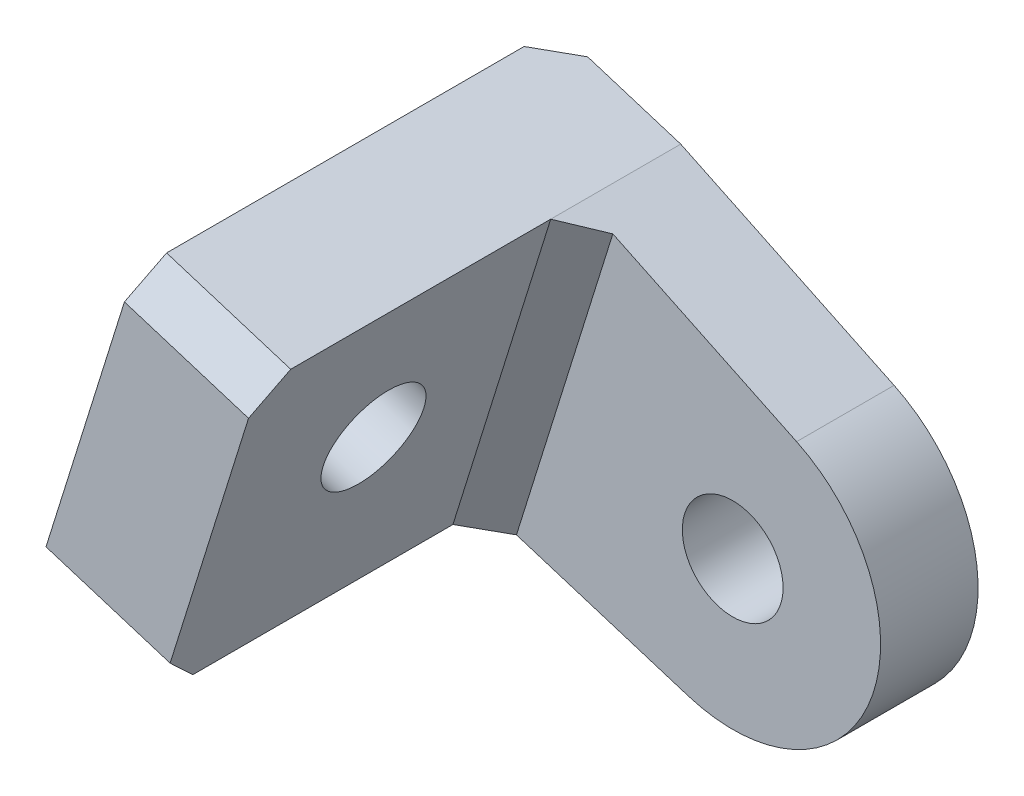
ISO-10303-21;
HEADER;
FILE_DESCRIPTION(('STEP AP214'),'2;1');
FILE_NAME('part.step','',(''),(''),'','','');
FILE_SCHEMA(('AUTOMOTIVE_DESIGN { 1 0 10303 214 1 1 1 1 }'));
ENDSEC;
DATA;
#1=APPLICATION_CONTEXT('core data for automotive mechanical design processes');
#2=APPLICATION_PROTOCOL_DEFINITION('international standard','automotive_design',2000,#1);
#3=PRODUCT_CONTEXT('',#1,'mechanical');
#4=PRODUCT('Part','Part','',(#3));
#5=PRODUCT_RELATED_PRODUCT_CATEGORY('part','',(#4));
#6=PRODUCT_DEFINITION_FORMATION('','',#4);
#7=PRODUCT_DEFINITION_CONTEXT('part definition',#1,'design');
#8=PRODUCT_DEFINITION('design','',#6,#7);
#9=PRODUCT_DEFINITION_SHAPE('','',#8);
#10=(LENGTH_UNIT() NAMED_UNIT(*) SI_UNIT(.MILLI.,.METRE.));
#11=(NAMED_UNIT(*) PLANE_ANGLE_UNIT() SI_UNIT($,.RADIAN.));
#12=(NAMED_UNIT(*) SI_UNIT($,.STERADIAN.) SOLID_ANGLE_UNIT());
#13=UNCERTAINTY_MEASURE_WITH_UNIT(LENGTH_MEASURE(1.E-05),#10,'distance_accuracy_value','');
#14=(GEOMETRIC_REPRESENTATION_CONTEXT(3) GLOBAL_UNCERTAINTY_ASSIGNED_CONTEXT((#13)) GLOBAL_UNIT_ASSIGNED_CONTEXT((#10,
#11,#12)) REPRESENTATION_CONTEXT('',''));
#15=CARTESIAN_POINT('',(0.,0.,0.));
#16=DIRECTION('',(0.,0.,1.));
#17=DIRECTION('',(1.,0.,0.));
#18=AXIS2_PLACEMENT_3D('',#15,#16,#17);
#19=CARTESIAN_POINT('',(12.6458721758377,26.3905196953717,3.));
#20=DIRECTION('',(0.432131708683439,0.90181050467952,0.));
#21=DIRECTION('',(-0.90181050467952,0.43213170868344,0.));
#22=AXIS2_PLACEMENT_3D('',#19,#20,#21);
#23=PLANE('',#22);
#24=DIRECTION('',(0.90181050467952,-0.432131708683439,0.));
#25=VECTOR('',#24,1.);
#26=CARTESIAN_POINT('',(12.6458721758377,26.3905196953717,0.));
#27=LINE('',#26,#25);
#28=CARTESIAN_POINT('',(2.67565379619653,31.1680727200756,0.));
#29=VERTEX_POINT('',#28);
#30=CARTESIAN_POINT('',(9.24108820924442,28.0220321977735,0.));
#31=VERTEX_POINT('',#30);
#32=EDGE_CURVE('E157',#29,#31,#27,.T.);
#33=ORIENTED_EDGE('',*,*,#32,.F.);
#34=DIRECTION('',(0.,0.,-1.));
#35=VECTOR('',#34,1.);
#36=CARTESIAN_POINT('',(2.67565379619653,31.1680727200756,3.));
#37=LINE('',#36,#35);
#38=CARTESIAN_POINT('',(2.67565379619653,31.1680727200756,4.00000000000001));
#39=VERTEX_POINT('',#38);
#40=EDGE_CURVE('E148',#39,#29,#37,.T.);
#41=ORIENTED_EDGE('',*,*,#40,.F.);
#42=DIRECTION('',(0.64100135330547,-0.307156557430796,-0.703400394006016));
#43=VECTOR('',#42,1.);
#44=CARTESIAN_POINT('',(3.33765436171891,30.8508537100461,3.27355620043639));
#45=LINE('',#44,#43);
#46=CARTESIAN_POINT('',(3.58694323926157,30.7313988710868,3.));
#47=VERTEX_POINT('',#46);
#48=EDGE_CURVE('E203',#39,#47,#45,.T.);
#49=ORIENTED_EDGE('',*,*,#48,.T.);
#50=DIRECTION('',(0.90181050467952,-0.432131708683439,0.));
#51=VECTOR('',#50,1.);
#52=CARTESIAN_POINT('',(12.6458721758377,26.3905196953717,3.));
#53=LINE('',#52,#51);
#54=CARTESIAN_POINT('',(9.24108820924442,28.0220321977735,3.));
#55=VERTEX_POINT('',#54);
#56=EDGE_CURVE('E141',#47,#55,#53,.T.);
#57=ORIENTED_EDGE('',*,*,#56,.T.);
#58=DIRECTION('',(0.,0.,-1.));
#59=VECTOR('',#58,1.);
#60=CARTESIAN_POINT('',(9.24108820924442,28.0220321977735,3.));
#61=LINE('',#60,#59);
#62=EDGE_CURVE('E127',#55,#31,#61,.T.);
#63=ORIENTED_EDGE('',*,*,#62,.T.);
#64=EDGE_LOOP('',(#33,#41,#49,#57,#63));
#65=FACE_BOUND('',#64,.T.);
#66=ADVANCED_FACE('F35',(#65),#23,.T.);
#67=CARTESIAN_POINT('',(9.10096871201294,29.1629022647186,3.));
#68=DIRECTION('',(0.297904049493287,0.954595818813125,0.));
#69=DIRECTION('',(-0.954595818813125,0.297904049493287,0.));
#70=AXIS2_PLACEMENT_3D('',#67,#68,#69);
#71=PLANE('',#70);
#72=DIRECTION('',(0.954595818813125,-0.297904049493287,0.));
#73=VECTOR('',#72,1.);
#74=CARTESIAN_POINT('',(9.10096871201294,29.1629022647186,0.));
#75=LINE('',#74,#73);
#76=CARTESIAN_POINT('',(-0.188133660242845,32.0617848685554,0.));
#77=VERTEX_POINT('',#76);
#78=EDGE_CURVE('E160',#77,#29,#75,.T.);
#79=ORIENTED_EDGE('',*,*,#78,.F.);
#80=DIRECTION('',(-0.675001176775085,0.210649973539636,0.707106781186549));
#81=VECTOR('',#80,1.);
#82=CARTESIAN_POINT('',(3.02452379766534,31.059199640877,-3.36546357588553));
#83=LINE('',#82,#81);
#84=CARTESIAN_POINT('',(-1.14272947905597,32.3596889180487,1.));
#85=VERTEX_POINT('',#84);
#86=EDGE_CURVE('E57',#77,#85,#83,.T.);
#87=ORIENTED_EDGE('',*,*,#86,.T.);
#88=DIRECTION('',(0.,0.,-1.));
#89=VECTOR('',#88,1.);
#90=CARTESIAN_POINT('',(-1.14272947905597,32.3596889180487,3.));
#91=LINE('',#90,#89);
#92=CARTESIAN_POINT('',(-1.14272947905597,32.3596889180487,12.));
#93=VERTEX_POINT('',#92);
#94=EDGE_CURVE('E169',#93,#85,#91,.T.);
#95=ORIENTED_EDGE('',*,*,#94,.F.);
#96=DIRECTION('',(0.954595818813125,-0.297904049493287,0.));
#97=VECTOR('',#96,1.);
#98=CARTESIAN_POINT('',(9.10096871201294,29.1629022647186,12.));
#99=LINE('',#98,#97);
#100=CARTESIAN_POINT('',(2.67565379619653,31.1680727200756,12.));
#101=VERTEX_POINT('',#100);
#102=EDGE_CURVE('E197',#93,#101,#99,.T.);
#103=ORIENTED_EDGE('',*,*,#102,.T.);
#104=DIRECTION('',(0.,0.,-1.));
#105=VECTOR('',#104,1.);
#106=CARTESIAN_POINT('',(2.67565379619653,31.1680727200756,13.));
#107=LINE('',#106,#105);
#108=EDGE_CURVE('E187',#101,#39,#107,.T.);
#109=ORIENTED_EDGE('',*,*,#108,.T.);
#110=ORIENTED_EDGE('',*,*,#40,.T.);
#111=EDGE_LOOP('',(#79,#87,#95,#103,#109,#110));
#112=FACE_BOUND('',#111,.T.);
#113=ADVANCED_FACE('F216',(#112),#71,.T.);
#114=CARTESIAN_POINT('',(-10.2436981910689,3.19678665333007,3.));
#115=DIRECTION('',(-0.954595818813125,0.297904049493287,0.));
#116=DIRECTION('',(-0.297904049493287,-0.954595818813125,0.));
#117=AXIS2_PLACEMENT_3D('',#114,#115,#116);
#118=PLANE('',#117);
#119=CARTESIAN_POINT('',(-2.54058132704005,27.8804496070172,8.05588909029522));
#120=DIRECTION('',(-0.954595818813125,0.297904049493287,0.));
#121=DIRECTION('',(-3.01133376189992E-12,-9.64943787454371E-12,-1.));
#122=AXIS2_PLACEMENT_3D('',#119,#120,#121);
#123=ELLIPSE('',#122,1.55,1.54999119407382);
#124=CARTESIAN_POINT('',(-2.54058132704471,27.8804496070023,6.50588909029522));
#125=VERTEX_POINT('',#124);
#126=EDGE_CURVE('E261',#125,#125,#123,.T.);
#127=ORIENTED_EDGE('',*,*,#126,.F.);
#128=EDGE_LOOP('',(#127));
#129=FACE_BOUND('',#128,.T.);
#130=ORIENTED_EDGE('',*,*,#94,.T.);
#131=DIRECTION('',(-0.297904049493287,-0.954595818813125,0.));
#132=VECTOR('',#131,1.);
#133=CARTESIAN_POINT('',(-4.15156037893817,22.7182711480361,1.));
#134=LINE('',#133,#132);
#135=CARTESIAN_POINT('',(-4.15156037893816,22.7182711480361,1.));
#136=VERTEX_POINT('',#135);
#137=EDGE_CURVE('E43',#85,#136,#134,.T.);
#138=ORIENTED_EDGE('',*,*,#137,.T.);
#139=DIRECTION('',(0.,0.,-1.));
#140=VECTOR('',#139,1.);
#141=CARTESIAN_POINT('',(-4.15156037893816,22.7182711480361,3.));
#142=LINE('',#141,#140);
#143=CARTESIAN_POINT('',(-4.15156037893817,22.7182711480361,12.));
#144=VERTEX_POINT('',#143);
#145=EDGE_CURVE('E126',#144,#136,#142,.T.);
#146=ORIENTED_EDGE('',*,*,#145,.F.);
#147=DIRECTION('',(-0.210649973539636,-0.675001176775085,-0.707106781186548));
#148=VECTOR('',#147,1.);
#149=CARTESIAN_POINT('',(-8.53819750772333,8.66184771602406,-2.72499999998831));
#150=LINE('',#149,#148);
#151=CARTESIAN_POINT('',(-3.85365632944488,23.6728669668493,13.));
#152=VERTEX_POINT('',#151);
#153=EDGE_CURVE('E195',#144,#152,#150,.F.);
#154=ORIENTED_EDGE('',*,*,#153,.T.);
#155=DIRECTION('',(-0.297904049493287,-0.954595818813125,0.));
#156=VECTOR('',#155,1.);
#157=CARTESIAN_POINT('',(-1.14272947905597,32.3596889180487,13.));
#158=LINE('',#157,#156);
#159=CARTESIAN_POINT('',(-1.44063352854926,31.4050930992356,13.));
#160=VERTEX_POINT('',#159);
#161=EDGE_CURVE('E256',#160,#152,#158,.T.);
#162=ORIENTED_EDGE('',*,*,#161,.F.);
#163=DIRECTION('',(-0.210649973539637,-0.675001176775088,0.707106781186546));
#164=VECTOR('',#163,1.);
#165=CARTESIAN_POINT('',(-4.35264561234267,22.0739189703484,22.7749999999883));
#166=LINE('',#165,#164);
#167=EDGE_CURVE('E193',#160,#93,#166,.F.);
#168=ORIENTED_EDGE('',*,*,#167,.T.);
#169=EDGE_LOOP('',(#130,#138,#146,#154,#162,#168));
#170=FACE_BOUND('',#169,.T.);
#171=ADVANCED_FACE('F218',(#129,#170),#118,.T.);
#172=CARTESIAN_POINT('',(6.09213781213073,19.5214844947061,3.));
#173=DIRECTION('',(-0.297904049493286,-0.954595818813125,0.));
#174=DIRECTION('',(0.954595818813126,-0.297904049493286,0.));
#175=AXIS2_PLACEMENT_3D('',#172,#173,#174);
#176=PLANE('',#175);
#177=ORIENTED_EDGE('',*,*,#145,.T.);
#178=DIRECTION('',(0.675001176775085,-0.210649973539635,-0.707106781186549));
#179=VECTOR('',#178,1.);
#180=CARTESIAN_POINT('',(0.0156928977831389,21.4177818708644,-3.36546357588553));
#181=LINE('',#180,#179);
#182=CARTESIAN_POINT('',(-3.19696456012504,22.4203670985429,0.));
#183=VERTEX_POINT('',#182);
#184=EDGE_CURVE('E11',#136,#183,#181,.T.);
#185=ORIENTED_EDGE('',*,*,#184,.T.);
#186=DIRECTION('',(-0.954595818813126,0.297904049493286,0.));
#187=VECTOR('',#186,1.);
#188=CARTESIAN_POINT('',(6.09213781213073,19.5214844947061,0.));
#189=LINE('',#188,#187);
#190=CARTESIAN_POINT('',(5.91942550954031,19.575383425882,0.));
#191=VERTEX_POINT('',#190);
#192=EDGE_CURVE('E122',#191,#183,#189,.T.);
#193=ORIENTED_EDGE('',*,*,#192,.F.);
#194=DIRECTION('',(0.,0.,-1.));
#195=VECTOR('',#194,1.);
#196=CARTESIAN_POINT('',(5.91942550954031,19.575383425882,3.));
#197=LINE('',#196,#195);
#198=CARTESIAN_POINT('',(5.91942550954031,19.575383425882,3.));
#199=VERTEX_POINT('',#198);
#200=EDGE_CURVE('E115',#199,#191,#197,.T.);
#201=ORIENTED_EDGE('',*,*,#200,.F.);
#202=DIRECTION('',(-0.954595818813126,0.297904049493286,0.));
#203=VECTOR('',#202,1.);
#204=CARTESIAN_POINT('',(6.09213781213073,19.5214844947061,3.));
#205=LINE('',#204,#203);
#206=CARTESIAN_POINT('',(0.621418715127459,21.2287509005697,3.));
#207=VERTEX_POINT('',#206);
#208=EDGE_CURVE('E119',#199,#207,#205,.T.);
#209=ORIENTED_EDGE('',*,*,#208,.T.);
#210=DIRECTION('',(-0.675001176775082,0.210649973539634,0.707106781186551));
#211=VECTOR('',#210,1.);
#212=CARTESIAN_POINT('',(-0.333177103685662,21.526654950063,4.00000000000001));
#213=LINE('',#212,#211);
#214=CARTESIAN_POINT('',(-0.333177103685661,21.526654950063,4.00000000000001));
#215=VERTEX_POINT('',#214);
#216=EDGE_CURVE('E205',#207,#215,#213,.T.);
#217=ORIENTED_EDGE('',*,*,#216,.T.);
#218=DIRECTION('',(0.,0.,-1.));
#219=VECTOR('',#218,1.);
#220=CARTESIAN_POINT('',(-0.333177103685661,21.526654950063,13.));
#221=LINE('',#220,#219);
#222=CARTESIAN_POINT('',(-0.333177103685661,21.526654950063,12.));
#223=VERTEX_POINT('',#222);
#224=EDGE_CURVE('E161',#223,#215,#221,.T.);
#225=ORIENTED_EDGE('',*,*,#224,.F.);
#226=DIRECTION('',(-0.954595818813126,0.297904049493286,0.));
#227=VECTOR('',#226,1.);
#228=CARTESIAN_POINT('',(6.09213781213073,19.5214844947061,12.));
#229=LINE('',#228,#227);
#230=EDGE_CURVE('E191',#223,#144,#229,.T.);
#231=ORIENTED_EDGE('',*,*,#230,.T.);
#232=EDGE_LOOP('',(#177,#185,#193,#201,#209,#217,#225,#231));
#233=FACE_BOUND('',#232,.T.);
#234=ADVANCED_FACE('F117',(#233),#176,.T.);
#235=CARTESIAN_POINT('',(7.27488893473476,23.9187944014817,3.));
#236=DIRECTION('',(0.,0.,-1.));
#237=DIRECTION('',(-1.,0.,0.));
#238=AXIS2_PLACEMENT_3D('',#235,#236,#237);
#239=CYLINDRICAL_SURFACE('',#238,4.55);
#240=CARTESIAN_POINT('',(7.27488893473476,23.9187944014817,0.));
#241=DIRECTION('',(0.,0.,1.));
#242=DIRECTION('',(1.,0.,0.));
#243=AXIS2_PLACEMENT_3D('',#240,#241,#242);
#244=CIRCLE('',#243,4.55);
#245=EDGE_CURVE('E164',#191,#31,#244,.T.);
#246=ORIENTED_EDGE('',*,*,#245,.T.);
#247=ORIENTED_EDGE('',*,*,#62,.F.);
#248=CARTESIAN_POINT('',(7.27488893473476,23.9187944014817,3.));
#249=DIRECTION('',(0.,0.,1.));
#250=DIRECTION('',(1.,0.,0.));
#251=AXIS2_PLACEMENT_3D('',#248,#249,#250);
#252=CIRCLE('',#251,4.55);
#253=EDGE_CURVE('E131',#199,#55,#252,.T.);
#254=ORIENTED_EDGE('',*,*,#253,.F.);
#255=ORIENTED_EDGE('',*,*,#200,.T.);
#256=EDGE_LOOP('',(#246,#247,#254,#255));
#257=FACE_BOUND('',#256,.T.);
#258=ADVANCED_FACE('F132',(#257),#239,.T.);
#259=CARTESIAN_POINT('',(7.27488893473476,23.9187944014817,3.));
#260=DIRECTION('',(0.,0.,-1.));
#261=DIRECTION('',(-1.,0.,0.));
#262=AXIS2_PLACEMENT_3D('',#259,#260,#261);
#263=CYLINDRICAL_SURFACE('',#262,1.55);
#264=CARTESIAN_POINT('',(7.27488893473476,23.9187944014817,3.));
#265=DIRECTION('',(0.,0.,1.));
#266=DIRECTION('',(1.,0.,0.));
#267=AXIS2_PLACEMENT_3D('',#264,#265,#266);
#268=CIRCLE('',#267,1.55);
#269=CARTESIAN_POINT('',(8.82488893473476,23.9187944014817,3.));
#270=VERTEX_POINT('',#269);
#271=EDGE_CURVE('E135',#270,#270,#268,.T.);
#272=ORIENTED_EDGE('',*,*,#271,.T.);
#273=EDGE_LOOP('',(#272));
#274=FACE_BOUND('',#273,.T.);
#275=CARTESIAN_POINT('',(7.27488893473476,23.9187944014817,0.));
#276=DIRECTION('',(0.,0.,1.));
#277=DIRECTION('',(1.,0.,0.));
#278=AXIS2_PLACEMENT_3D('',#275,#276,#277);
#279=CIRCLE('',#278,1.55);
#280=CARTESIAN_POINT('',(8.82488893473476,23.9187944014817,0.));
#281=VERTEX_POINT('',#280);
#282=EDGE_CURVE('E143',#281,#281,#279,.T.);
#283=ORIENTED_EDGE('',*,*,#282,.F.);
#284=EDGE_LOOP('',(#283));
#285=FACE_BOUND('',#284,.T.);
#286=ADVANCED_FACE('F280',(#274,#285),#263,.F.);
#287=CARTESIAN_POINT('',(0.,0.,3.));
#288=DIRECTION('',(0.,0.,1.));
#289=DIRECTION('',(1.,0.,0.));
#290=AXIS2_PLACEMENT_3D('',#287,#288,#289);
#291=PLANE('',#290);
#292=ORIENTED_EDGE('',*,*,#56,.F.);
#293=DIRECTION('',(-0.297904049493286,-0.954595818813126,0.));
#294=VECTOR('',#293,1.);
#295=CARTESIAN_POINT('',(-5.47071909700327,1.70726640586362,3.));
#296=LINE('',#295,#294);
#297=EDGE_CURVE('E140',#47,#207,#296,.T.);
#298=ORIENTED_EDGE('',*,*,#297,.T.);
#299=ORIENTED_EDGE('',*,*,#208,.F.);
#300=ORIENTED_EDGE('',*,*,#253,.T.);
#301=EDGE_LOOP('',(#292,#298,#299,#300));
#302=FACE_BOUND('',#301,.T.);
#303=ORIENTED_EDGE('',*,*,#271,.F.);
#304=EDGE_LOOP('',(#303));
#305=FACE_BOUND('',#304,.T.);
#306=ADVANCED_FACE('F137',(#302,#305),#291,.T.);
#307=CARTESIAN_POINT('',(0.,0.,0.));
#308=DIRECTION('',(0.,0.,1.));
#309=DIRECTION('',(1.,0.,0.));
#310=AXIS2_PLACEMENT_3D('',#307,#308,#309);
#311=PLANE('',#310);
#312=ORIENTED_EDGE('',*,*,#192,.T.);
#313=DIRECTION('',(0.297904049493287,0.954595818813125,0.));
#314=VECTOR('',#313,1.);
#315=CARTESIAN_POINT('',(-0.188133660242844,32.0617848685554,0.));
#316=LINE('',#315,#314);
#317=EDGE_CURVE('E207',#183,#77,#316,.T.);
#318=ORIENTED_EDGE('',*,*,#317,.T.);
#319=ORIENTED_EDGE('',*,*,#78,.T.);
#320=ORIENTED_EDGE('',*,*,#32,.T.);
#321=ORIENTED_EDGE('',*,*,#245,.F.);
#322=EDGE_LOOP('',(#312,#318,#319,#320,#321));
#323=FACE_BOUND('',#322,.T.);
#324=ORIENTED_EDGE('',*,*,#282,.T.);
#325=EDGE_LOOP('',(#324));
#326=FACE_BOUND('',#325,.T.);
#327=ADVANCED_FACE('F212',(#323,#326),#311,.F.);
#328=CARTESIAN_POINT('',(-0.333177103685661,21.526654950063,13.));
#329=DIRECTION('',(-0.954595818813125,0.297904049493286,0.));
#330=DIRECTION('',(-0.297904049493286,-0.954595818813126,0.));
#331=AXIS2_PLACEMENT_3D('',#328,#329,#330);
#332=PLANE('',#331);
#333=CARTESIAN_POINT('',(1.27780194821246,26.6888334090441,8.05588909029522));
#334=DIRECTION('',(-0.954595818813125,0.297904049493287,0.));
#335=DIRECTION('',(-3.01133376189992E-12,-9.64943787454371E-12,-1.));
#336=AXIS2_PLACEMENT_3D('',#333,#334,#335);
#337=ELLIPSE('',#336,1.55,1.54999119407382);
#338=CARTESIAN_POINT('',(1.27780194820779,26.6888334090291,6.50588909029522));
#339=VERTEX_POINT('',#338);
#340=EDGE_CURVE('E257',#339,#339,#337,.F.);
#341=ORIENTED_EDGE('',*,*,#340,.F.);
#342=EDGE_LOOP('',(#341));
#343=FACE_BOUND('',#342,.T.);
#344=ORIENTED_EDGE('',*,*,#224,.T.);
#345=DIRECTION('',(0.297904049493286,0.954595818813126,0.));
#346=VECTOR('',#345,1.);
#347=CARTESIAN_POINT('',(-0.333177103685661,21.526654950063,4.00000000000001));
#348=LINE('',#347,#346);
#349=EDGE_CURVE('E199',#215,#39,#348,.T.);
#350=ORIENTED_EDGE('',*,*,#349,.T.);
#351=ORIENTED_EDGE('',*,*,#108,.F.);
#352=DIRECTION('',(0.210649973539636,0.675001176775088,-0.707106781186546));
#353=VECTOR('',#352,1.);
#354=CARTESIAN_POINT('',(2.37774974670324,30.2134769012624,13.));
#355=LINE('',#354,#353);
#356=CARTESIAN_POINT('',(2.37774974670324,30.2134769012624,13.));
#357=VERTEX_POINT('',#356);
#358=EDGE_CURVE('E182',#101,#357,#355,.F.);
#359=ORIENTED_EDGE('',*,*,#358,.T.);
#360=DIRECTION('',(0.297904049493286,0.954595818813126,0.));
#361=VECTOR('',#360,1.);
#362=CARTESIAN_POINT('',(-0.333177103685661,21.526654950063,13.));
#363=LINE('',#362,#361);
#364=CARTESIAN_POINT('',(-0.035273054192375,22.4812507688761,13.));
#365=VERTEX_POINT('',#364);
#366=EDGE_CURVE('E252',#365,#357,#363,.T.);
#367=ORIENTED_EDGE('',*,*,#366,.F.);
#368=DIRECTION('',(0.210649973539635,0.675001176775085,0.707106781186548));
#369=VECTOR('',#368,1.);
#370=CARTESIAN_POINT('',(-0.0352730541923751,22.4812507688761,13.));
#371=LINE('',#370,#369);
#372=EDGE_CURVE('E189',#365,#223,#371,.F.);
#373=ORIENTED_EDGE('',*,*,#372,.T.);
#374=EDGE_LOOP('',(#344,#350,#351,#359,#367,#373));
#375=FACE_BOUND('',#374,.T.);
#376=ADVANCED_FACE('F249',(#343,#375),#332,.F.);
#377=CARTESIAN_POINT('',(0.,0.,13.));
#378=DIRECTION('',(0.,0.,1.));
#379=DIRECTION('',(1.,0.,0.));
#380=AXIS2_PLACEMENT_3D('',#377,#378,#379);
#381=PLANE('',#380);
#382=ORIENTED_EDGE('',*,*,#161,.T.);
#383=DIRECTION('',(0.954595818813126,-0.297904049493286,0.));
#384=VECTOR('',#383,1.);
#385=CARTESIAN_POINT('',(6.39004186162402,20.4760803135192,13.));
#386=LINE('',#385,#384);
#387=EDGE_CURVE('E175',#152,#365,#386,.T.);
#388=ORIENTED_EDGE('',*,*,#387,.T.);
#389=ORIENTED_EDGE('',*,*,#366,.T.);
#390=DIRECTION('',(-0.954595818813125,0.297904049493287,0.));
#391=VECTOR('',#390,1.);
#392=CARTESIAN_POINT('',(8.80306466251966,28.2083064459055,13.));
#393=LINE('',#392,#391);
#394=EDGE_CURVE('E171',#357,#160,#393,.T.);
#395=ORIENTED_EDGE('',*,*,#394,.T.);
#396=EDGE_LOOP('',(#382,#388,#389,#395));
#397=FACE_BOUND('',#396,.T.);
#398=ADVANCED_FACE('F255',(#397),#381,.T.);
#399=CARTESIAN_POINT('',(12.9717218675151,23.0394709985301,8.05588909029522));
#400=DIRECTION('',(-0.954595818813125,0.297904049493287,0.));
#401=DIRECTION('',(-3.01133376189992E-12,-9.64943787454371E-12,-1.));
#402=AXIS2_PLACEMENT_3D('',#399,#400,#401);
#403=ELLIPSE('',#402,1.55,1.54999119407382);
#404=DIRECTION('',(-0.954595818813125,0.297904049493287,0.));
#405=VECTOR('',#404,1.);
#406=SURFACE_OF_LINEAR_EXTRUSION('',#403,#405);
#407=ORIENTED_EDGE('',*,*,#126,.T.);
#408=EDGE_LOOP('',(#407));
#409=FACE_BOUND('',#408,.T.);
#410=ORIENTED_EDGE('',*,*,#340,.T.);
#411=EDGE_LOOP('',(#410));
#412=FACE_BOUND('',#411,.T.);
#413=ADVANCED_FACE('F234',(#409,#412),#406,.F.);
#414=CARTESIAN_POINT('',(6.39004186162402,20.4760803135192,13.));
#415=DIRECTION('',(0.210649973539636,0.675001176775087,-0.707106781186547));
#416=DIRECTION('',(0.954595818813126,-0.297904049493286,0.));
#417=AXIS2_PLACEMENT_3D('',#414,#415,#416);
#418=PLANE('',#417);
#419=ORIENTED_EDGE('',*,*,#153,.F.);
#420=ORIENTED_EDGE('',*,*,#230,.F.);
#421=ORIENTED_EDGE('',*,*,#372,.F.);
#422=ORIENTED_EDGE('',*,*,#387,.F.);
#423=EDGE_LOOP('',(#419,#420,#421,#422));
#424=FACE_BOUND('',#423,.T.);
#425=ADVANCED_FACE('F230',(#424),#418,.F.);
#426=CARTESIAN_POINT('',(8.80306466251965,28.2083064459055,13.));
#427=DIRECTION('',(-0.210649973539635,-0.675001176775084,-0.707106781186549));
#428=DIRECTION('',(-0.954595818813125,0.297904049493287,0.));
#429=AXIS2_PLACEMENT_3D('',#426,#427,#428);
#430=PLANE('',#429);
#431=ORIENTED_EDGE('',*,*,#358,.F.);
#432=ORIENTED_EDGE('',*,*,#102,.F.);
#433=ORIENTED_EDGE('',*,*,#167,.F.);
#434=ORIENTED_EDGE('',*,*,#394,.F.);
#435=EDGE_LOOP('',(#431,#432,#433,#434));
#436=FACE_BOUND('',#435,.T.);
#437=ADVANCED_FACE('F233',(#436),#430,.F.);
#438=CARTESIAN_POINT('',(-0.333177103685661,21.526654950063,4.00000000000001));
#439=DIRECTION('',(-0.67500117677509,0.210649973539637,-0.707106781186543));
#440=DIRECTION('',(0.297904049493286,0.954595818813126,0.));
#441=AXIS2_PLACEMENT_3D('',#438,#439,#440);
#442=PLANE('',#441);
#443=ORIENTED_EDGE('',*,*,#216,.F.);
#444=ORIENTED_EDGE('',*,*,#297,.F.);
#445=ORIENTED_EDGE('',*,*,#48,.F.);
#446=ORIENTED_EDGE('',*,*,#349,.F.);
#447=EDGE_LOOP('',(#443,#444,#445,#446));
#448=FACE_BOUND('',#447,.T.);
#449=ADVANCED_FACE('F237',(#448),#442,.F.);
#450=CARTESIAN_POINT('',(-9.28910237225579,2.89888260383678,0.));
#451=DIRECTION('',(-0.675001176775087,0.210649973539637,-0.707106781186546));
#452=DIRECTION('',(-0.297904049493287,-0.954595818813125,0.));
#453=AXIS2_PLACEMENT_3D('',#450,#451,#452);
#454=PLANE('',#453);
#455=ORIENTED_EDGE('',*,*,#184,.F.);
#456=ORIENTED_EDGE('',*,*,#137,.F.);
#457=ORIENTED_EDGE('',*,*,#86,.F.);
#458=ORIENTED_EDGE('',*,*,#317,.F.);
#459=EDGE_LOOP('',(#455,#456,#457,#458));
#460=FACE_BOUND('',#459,.T.);
#461=ADVANCED_FACE('F37',(#460),#454,.T.);
#462=CLOSED_SHELL('',(#66,#113,#171,#234,#258,#286,#306,#327,#376,#398,#413,#425,#437,#449,#461));
#463=MANIFOLD_SOLID_BREP('B2',#462);
#464=ADVANCED_BREP_SHAPE_REPRESENTATION('',(#18,#463),#14);
#465=SHAPE_DEFINITION_REPRESENTATION(#9,#464);
ENDSEC;
END-ISO-10303-21;
